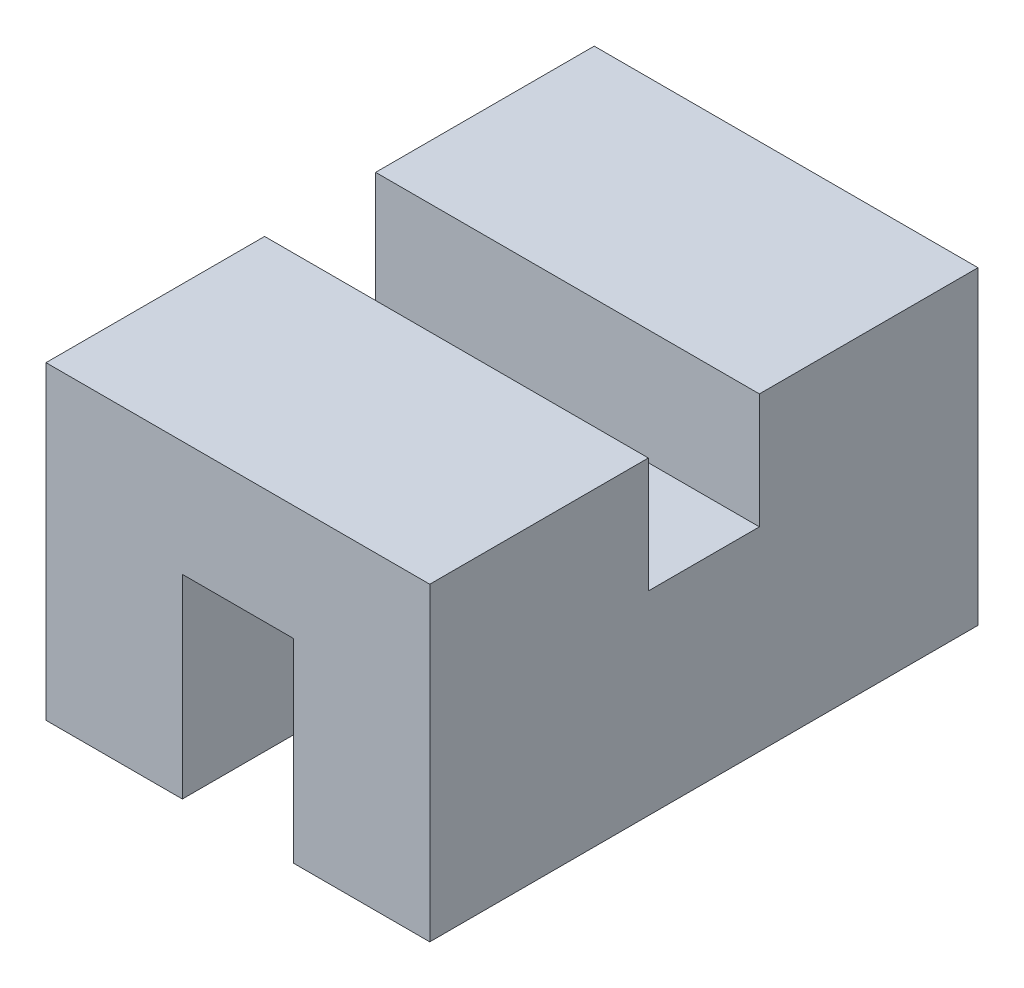
ISO-10303-21;
HEADER;
FILE_DESCRIPTION(('STEP AP214'),'2;1');
FILE_NAME('part.step','',(''),(''),'','','');
FILE_SCHEMA(('AUTOMOTIVE_DESIGN { 1 0 10303 214 1 1 1 1 }'));
ENDSEC;
DATA;
#1=APPLICATION_CONTEXT('core data for automotive mechanical design processes');
#2=APPLICATION_PROTOCOL_DEFINITION('international standard','automotive_design',2000,#1);
#3=PRODUCT_CONTEXT('',#1,'mechanical');
#4=PRODUCT('Part','Part','',(#3));
#5=PRODUCT_RELATED_PRODUCT_CATEGORY('part','',(#4));
#6=PRODUCT_DEFINITION_FORMATION('','',#4);
#7=PRODUCT_DEFINITION_CONTEXT('part definition',#1,'design');
#8=PRODUCT_DEFINITION('design','',#6,#7);
#9=PRODUCT_DEFINITION_SHAPE('','',#8);
#10=(LENGTH_UNIT() NAMED_UNIT(*) SI_UNIT(.MILLI.,.METRE.));
#11=(NAMED_UNIT(*) PLANE_ANGLE_UNIT() SI_UNIT($,.RADIAN.));
#12=(NAMED_UNIT(*) SI_UNIT($,.STERADIAN.) SOLID_ANGLE_UNIT());
#13=UNCERTAINTY_MEASURE_WITH_UNIT(LENGTH_MEASURE(1.E-05),#10,'distance_accuracy_value','');
#14=(GEOMETRIC_REPRESENTATION_CONTEXT(3) GLOBAL_UNCERTAINTY_ASSIGNED_CONTEXT((#13)) GLOBAL_UNIT_ASSIGNED_CONTEXT((#10,
#11,#12)) REPRESENTATION_CONTEXT('',''));
#15=CARTESIAN_POINT('',(0.,0.,0.));
#16=DIRECTION('',(0.,0.,1.));
#17=DIRECTION('',(1.,0.,0.));
#18=AXIS2_PLACEMENT_3D('',#15,#16,#17);
#19=CARTESIAN_POINT('',(0.,5.8,0.));
#20=DIRECTION('',(0.,-1.,0.));
#21=DIRECTION('',(0.,0.,-1.));
#22=AXIS2_PLACEMENT_3D('',#19,#20,#21);
#23=PLANE('',#22);
#24=DIRECTION('',(-1.,0.,0.));
#25=VECTOR('',#24,1.);
#26=CARTESIAN_POINT('',(0.,5.8,-15.95));
#27=LINE('',#26,#25);
#28=CARTESIAN_POINT('',(9.95,5.8,-15.95));
#29=VERTEX_POINT('',#28);
#30=CARTESIAN_POINT('',(0.,5.8,-15.95));
#31=VERTEX_POINT('',#30);
#32=EDGE_CURVE('E208',#29,#31,#27,.T.);
#33=ORIENTED_EDGE('',*,*,#32,.F.);
#34=DIRECTION('',(0.,0.,1.));
#35=VECTOR('',#34,1.);
#36=CARTESIAN_POINT('',(9.95,5.8,0.));
#37=LINE('',#36,#35);
#38=CARTESIAN_POINT('',(9.95,5.8,-24.05));
#39=VERTEX_POINT('',#38);
#40=EDGE_CURVE('E160',#39,#29,#37,.T.);
#41=ORIENTED_EDGE('',*,*,#40,.F.);
#42=DIRECTION('',(1.,0.,0.));
#43=VECTOR('',#42,1.);
#44=CARTESIAN_POINT('',(0.,5.8,-24.05));
#45=LINE('',#44,#43);
#46=CARTESIAN_POINT('',(0.,5.8,-24.05));
#47=VERTEX_POINT('',#46);
#48=EDGE_CURVE('E191',#47,#39,#45,.T.);
#49=ORIENTED_EDGE('',*,*,#48,.F.);
#50=DIRECTION('',(0.,0.,1.));
#51=VECTOR('',#50,1.);
#52=CARTESIAN_POINT('',(0.,5.8,0.));
#53=LINE('',#52,#51);
#54=EDGE_CURVE('E230',#47,#31,#53,.T.);
#55=ORIENTED_EDGE('',*,*,#54,.T.);
#56=EDGE_LOOP('',(#33,#41,#49,#55));
#57=FACE_BOUND('',#56,.T.);
#58=ADVANCED_FACE('F32',(#57),#23,.F.);
#59=CARTESIAN_POINT('',(18.05,5.8,-24.05));
#60=VERTEX_POINT('',#59);
#61=CARTESIAN_POINT('',(28.,5.8,-24.05));
#62=VERTEX_POINT('',#61);
#63=EDGE_CURVE('E55',#60,#62,#45,.T.);
#64=ORIENTED_EDGE('',*,*,#63,.F.);
#65=DIRECTION('',(0.,0.,-1.));
#66=VECTOR('',#65,1.);
#67=CARTESIAN_POINT('',(18.05,5.8,0.));
#68=LINE('',#67,#66);
#69=CARTESIAN_POINT('',(18.05,5.8,-15.95));
#70=VERTEX_POINT('',#69);
#71=EDGE_CURVE('E47',#70,#60,#68,.T.);
#72=ORIENTED_EDGE('',*,*,#71,.F.);
#73=CARTESIAN_POINT('',(28.,5.8,-15.95));
#74=VERTEX_POINT('',#73);
#75=EDGE_CURVE('E213',#74,#70,#27,.T.);
#76=ORIENTED_EDGE('',*,*,#75,.F.);
#77=DIRECTION('',(0.,0.,-1.));
#78=VECTOR('',#77,1.);
#79=CARTESIAN_POINT('',(28.,5.8,-40.));
#80=LINE('',#79,#78);
#81=EDGE_CURVE('E228',#74,#62,#80,.T.);
#82=ORIENTED_EDGE('',*,*,#81,.T.);
#83=EDGE_LOOP('',(#64,#72,#76,#82));
#84=FACE_BOUND('',#83,.T.);
#85=ADVANCED_FACE('F273',(#84),#23,.F.);
#86=CARTESIAN_POINT('',(28.,5.8,0.));
#87=DIRECTION('',(0.,0.,-1.));
#88=DIRECTION('',(-1.,0.,0.));
#89=AXIS2_PLACEMENT_3D('',#86,#87,#88);
#90=PLANE('',#89);
#91=DIRECTION('',(0.,1.,0.));
#92=VECTOR('',#91,1.);
#93=CARTESIAN_POINT('',(9.95,-8.4,0.));
#94=LINE('',#93,#92);
#95=CARTESIAN_POINT('',(9.95,-8.4,0.));
#96=VERTEX_POINT('',#95);
#97=CARTESIAN_POINT('',(9.95,5.8,0.));
#98=VERTEX_POINT('',#97);
#99=EDGE_CURVE('E183',#96,#98,#94,.T.);
#100=ORIENTED_EDGE('',*,*,#99,.T.);
#101=DIRECTION('',(1.,0.,0.));
#102=VECTOR('',#101,1.);
#103=CARTESIAN_POINT('',(9.95,5.8,0.));
#104=LINE('',#103,#102);
#105=CARTESIAN_POINT('',(18.05,5.8,0.));
#106=VERTEX_POINT('',#105);
#107=EDGE_CURVE('E269',#98,#106,#104,.T.);
#108=ORIENTED_EDGE('',*,*,#107,.T.);
#109=DIRECTION('',(0.,1.,0.));
#110=VECTOR('',#109,1.);
#111=CARTESIAN_POINT('',(18.05,-8.4,0.));
#112=LINE('',#111,#110);
#113=CARTESIAN_POINT('',(18.05,-8.4,0.));
#114=VERTEX_POINT('',#113);
#115=EDGE_CURVE('E144',#114,#106,#112,.T.);
#116=ORIENTED_EDGE('',*,*,#115,.F.);
#117=DIRECTION('',(-1.,0.,0.));
#118=VECTOR('',#117,1.);
#119=CARTESIAN_POINT('',(18.05,-8.4,0.));
#120=LINE('',#119,#118);
#121=CARTESIAN_POINT('',(28.,-8.4,0.));
#122=VERTEX_POINT('',#121);
#123=EDGE_CURVE('E158',#122,#114,#120,.T.);
#124=ORIENTED_EDGE('',*,*,#123,.F.);
#125=DIRECTION('',(0.,-1.,0.));
#126=VECTOR('',#125,1.);
#127=CARTESIAN_POINT('',(28.,5.8,0.));
#128=LINE('',#127,#126);
#129=CARTESIAN_POINT('',(28.,14.2,0.));
#130=VERTEX_POINT('',#129);
#131=EDGE_CURVE('E11',#130,#122,#128,.T.);
#132=ORIENTED_EDGE('',*,*,#131,.F.);
#133=DIRECTION('',(1.,0.,0.));
#134=VECTOR('',#133,1.);
#135=CARTESIAN_POINT('',(0.,14.2,0.));
#136=LINE('',#135,#134);
#137=CARTESIAN_POINT('',(0.,14.2,0.));
#138=VERTEX_POINT('',#137);
#139=EDGE_CURVE('E212',#138,#130,#136,.T.);
#140=ORIENTED_EDGE('',*,*,#139,.F.);
#141=DIRECTION('',(0.,-1.,0.));
#142=VECTOR('',#141,1.);
#143=CARTESIAN_POINT('',(0.,5.8,0.));
#144=LINE('',#143,#142);
#145=CARTESIAN_POINT('',(0.,-8.4,0.));
#146=VERTEX_POINT('',#145);
#147=EDGE_CURVE('E233',#138,#146,#144,.T.);
#148=ORIENTED_EDGE('',*,*,#147,.T.);
#149=DIRECTION('',(-1.,0.,0.));
#150=VECTOR('',#149,1.);
#151=CARTESIAN_POINT('',(0.,-8.4,0.));
#152=LINE('',#151,#150);
#153=EDGE_CURVE('E180',#96,#146,#152,.T.);
#154=ORIENTED_EDGE('',*,*,#153,.F.);
#155=EDGE_LOOP('',(#100,#108,#116,#124,#132,#140,#148,#154));
#156=FACE_BOUND('',#155,.T.);
#157=ADVANCED_FACE('F34',(#156),#90,.F.);
#158=CARTESIAN_POINT('',(28.,5.8,-40.));
#159=DIRECTION('',(-1.,0.,0.));
#160=DIRECTION('',(0.,0.,1.));
#161=AXIS2_PLACEMENT_3D('',#158,#159,#160);
#162=PLANE('',#161);
#163=ORIENTED_EDGE('',*,*,#131,.T.);
#164=DIRECTION('',(0.,0.,1.));
#165=VECTOR('',#164,1.);
#166=CARTESIAN_POINT('',(28.,-8.4,0.));
#167=LINE('',#166,#165);
#168=CARTESIAN_POINT('',(28.,-8.4,-40.));
#169=VERTEX_POINT('',#168);
#170=EDGE_CURVE('E145',#169,#122,#167,.T.);
#171=ORIENTED_EDGE('',*,*,#170,.F.);
#172=DIRECTION('',(0.,-1.,0.));
#173=VECTOR('',#172,1.);
#174=CARTESIAN_POINT('',(28.,5.8,-40.));
#175=LINE('',#174,#173);
#176=CARTESIAN_POINT('',(28.,14.2,-40.));
#177=VERTEX_POINT('',#176);
#178=EDGE_CURVE('E40',#177,#169,#175,.T.);
#179=ORIENTED_EDGE('',*,*,#178,.F.);
#180=DIRECTION('',(0.,0.,-1.));
#181=VECTOR('',#180,1.);
#182=CARTESIAN_POINT('',(28.,14.2,-40.));
#183=LINE('',#182,#181);
#184=CARTESIAN_POINT('',(28.,14.2,-24.05));
#185=VERTEX_POINT('',#184);
#186=EDGE_CURVE('E193',#185,#177,#183,.T.);
#187=ORIENTED_EDGE('',*,*,#186,.F.);
#188=DIRECTION('',(0.,-1.,0.));
#189=VECTOR('',#188,1.);
#190=CARTESIAN_POINT('',(28.,14.2,-24.05));
#191=LINE('',#190,#189);
#192=EDGE_CURVE('E199',#185,#62,#191,.T.);
#193=ORIENTED_EDGE('',*,*,#192,.T.);
#194=ORIENTED_EDGE('',*,*,#81,.F.);
#195=DIRECTION('',(0.,-1.,0.));
#196=VECTOR('',#195,1.);
#197=CARTESIAN_POINT('',(28.,14.2,-15.95));
#198=LINE('',#197,#196);
#199=CARTESIAN_POINT('',(28.,14.2,-15.95));
#200=VERTEX_POINT('',#199);
#201=EDGE_CURVE('E225',#200,#74,#198,.T.);
#202=ORIENTED_EDGE('',*,*,#201,.F.);
#203=DIRECTION('',(0.,0.,-1.));
#204=VECTOR('',#203,1.);
#205=CARTESIAN_POINT('',(28.,14.2,0.));
#206=LINE('',#205,#204);
#207=EDGE_CURVE('E216',#130,#200,#206,.T.);
#208=ORIENTED_EDGE('',*,*,#207,.F.);
#209=EDGE_LOOP('',(#163,#171,#179,#187,#193,#194,#202,#208));
#210=FACE_BOUND('',#209,.T.);
#211=ADVANCED_FACE('F243',(#210),#162,.F.);
#212=CARTESIAN_POINT('',(0.,5.8,-40.));
#213=DIRECTION('',(0.,0.,1.));
#214=DIRECTION('',(1.,0.,0.));
#215=AXIS2_PLACEMENT_3D('',#212,#213,#214);
#216=PLANE('',#215);
#217=DIRECTION('',(-1.,0.,0.));
#218=VECTOR('',#217,1.);
#219=CARTESIAN_POINT('',(9.95,5.8,-40.));
#220=LINE('',#219,#218);
#221=CARTESIAN_POINT('',(18.05,5.8,-40.));
#222=VERTEX_POINT('',#221);
#223=CARTESIAN_POINT('',(9.95,5.8,-40.));
#224=VERTEX_POINT('',#223);
#225=EDGE_CURVE('E141',#222,#224,#220,.T.);
#226=ORIENTED_EDGE('',*,*,#225,.T.);
#227=DIRECTION('',(0.,1.,0.));
#228=VECTOR('',#227,1.);
#229=CARTESIAN_POINT('',(9.95,-8.4,-40.));
#230=LINE('',#229,#228);
#231=CARTESIAN_POINT('',(9.95,-8.4,-40.));
#232=VERTEX_POINT('',#231);
#233=EDGE_CURVE('E185',#232,#224,#230,.T.);
#234=ORIENTED_EDGE('',*,*,#233,.F.);
#235=DIRECTION('',(1.,0.,0.));
#236=VECTOR('',#235,1.);
#237=CARTESIAN_POINT('',(0.,-8.4,-40.));
#238=LINE('',#237,#236);
#239=CARTESIAN_POINT('',(0.,-8.4,-40.));
#240=VERTEX_POINT('',#239);
#241=EDGE_CURVE('E176',#240,#232,#238,.T.);
#242=ORIENTED_EDGE('',*,*,#241,.F.);
#243=DIRECTION('',(0.,-1.,0.));
#244=VECTOR('',#243,1.);
#245=CARTESIAN_POINT('',(0.,5.8,-40.));
#246=LINE('',#245,#244);
#247=CARTESIAN_POINT('',(0.,14.2,-40.));
#248=VERTEX_POINT('',#247);
#249=EDGE_CURVE('E235',#248,#240,#246,.T.);
#250=ORIENTED_EDGE('',*,*,#249,.F.);
#251=DIRECTION('',(-1.,0.,0.));
#252=VECTOR('',#251,1.);
#253=CARTESIAN_POINT('',(0.,14.2,-40.));
#254=LINE('',#253,#252);
#255=EDGE_CURVE('E196',#177,#248,#254,.T.);
#256=ORIENTED_EDGE('',*,*,#255,.F.);
#257=ORIENTED_EDGE('',*,*,#178,.T.);
#258=DIRECTION('',(1.,0.,0.));
#259=VECTOR('',#258,1.);
#260=CARTESIAN_POINT('',(18.05,-8.4,-40.));
#261=LINE('',#260,#259);
#262=CARTESIAN_POINT('',(18.05,-8.4,-40.));
#263=VERTEX_POINT('',#262);
#264=EDGE_CURVE('E143',#263,#169,#261,.T.);
#265=ORIENTED_EDGE('',*,*,#264,.F.);
#266=DIRECTION('',(0.,1.,0.));
#267=VECTOR('',#266,1.);
#268=CARTESIAN_POINT('',(18.05,-8.4,-40.));
#269=LINE('',#268,#267);
#270=EDGE_CURVE('E137',#263,#222,#269,.T.);
#271=ORIENTED_EDGE('',*,*,#270,.T.);
#272=EDGE_LOOP('',(#226,#234,#242,#250,#256,#257,#265,#271));
#273=FACE_BOUND('',#272,.T.);
#274=ADVANCED_FACE('F138',(#273),#216,.F.);
#275=CARTESIAN_POINT('',(0.,5.8,0.));
#276=DIRECTION('',(1.,0.,0.));
#277=DIRECTION('',(0.,0.,-1.));
#278=AXIS2_PLACEMENT_3D('',#275,#276,#277);
#279=PLANE('',#278);
#280=ORIENTED_EDGE('',*,*,#249,.T.);
#281=DIRECTION('',(0.,0.,-1.));
#282=VECTOR('',#281,1.);
#283=CARTESIAN_POINT('',(0.,-8.4,0.));
#284=LINE('',#283,#282);
#285=EDGE_CURVE('E173',#146,#240,#284,.T.);
#286=ORIENTED_EDGE('',*,*,#285,.F.);
#287=ORIENTED_EDGE('',*,*,#147,.F.);
#288=DIRECTION('',(0.,0.,1.));
#289=VECTOR('',#288,1.);
#290=CARTESIAN_POINT('',(0.,14.2,0.));
#291=LINE('',#290,#289);
#292=CARTESIAN_POINT('',(0.,14.2,-15.95));
#293=VERTEX_POINT('',#292);
#294=EDGE_CURVE('E209',#293,#138,#291,.T.);
#295=ORIENTED_EDGE('',*,*,#294,.F.);
#296=DIRECTION('',(0.,-1.,0.));
#297=VECTOR('',#296,1.);
#298=CARTESIAN_POINT('',(0.,14.2,-15.95));
#299=LINE('',#298,#297);
#300=EDGE_CURVE('E220',#293,#31,#299,.T.);
#301=ORIENTED_EDGE('',*,*,#300,.T.);
#302=ORIENTED_EDGE('',*,*,#54,.F.);
#303=DIRECTION('',(0.,-1.,0.));
#304=VECTOR('',#303,1.);
#305=CARTESIAN_POINT('',(0.,14.2,-24.05));
#306=LINE('',#305,#304);
#307=CARTESIAN_POINT('',(0.,14.2,-24.05));
#308=VERTEX_POINT('',#307);
#309=EDGE_CURVE('E205',#308,#47,#306,.T.);
#310=ORIENTED_EDGE('',*,*,#309,.F.);
#311=DIRECTION('',(0.,0.,1.));
#312=VECTOR('',#311,1.);
#313=CARTESIAN_POINT('',(0.,14.2,-40.));
#314=LINE('',#313,#312);
#315=EDGE_CURVE('E187',#248,#308,#314,.T.);
#316=ORIENTED_EDGE('',*,*,#315,.F.);
#317=EDGE_LOOP('',(#280,#286,#287,#295,#301,#302,#310,#316));
#318=FACE_BOUND('',#317,.T.);
#319=ADVANCED_FACE('F255',(#318),#279,.F.);
#320=CARTESIAN_POINT('',(0.,14.2,-15.95));
#321=DIRECTION('',(0.,0.,1.));
#322=DIRECTION('',(1.,0.,0.));
#323=AXIS2_PLACEMENT_3D('',#320,#321,#322);
#324=PLANE('',#323);
#325=ORIENTED_EDGE('',*,*,#75,.T.);
#326=DIRECTION('',(1.,0.,0.));
#327=VECTOR('',#326,1.);
#328=CARTESIAN_POINT('',(0.,5.8,-15.95));
#329=LINE('',#328,#327);
#330=EDGE_CURVE('E156',#29,#70,#329,.T.);
#331=ORIENTED_EDGE('',*,*,#330,.F.);
#332=ORIENTED_EDGE('',*,*,#32,.T.);
#333=ORIENTED_EDGE('',*,*,#300,.F.);
#334=DIRECTION('',(-1.,0.,0.));
#335=VECTOR('',#334,1.);
#336=CARTESIAN_POINT('',(0.,14.2,-15.95));
#337=LINE('',#336,#335);
#338=EDGE_CURVE('E218',#200,#293,#337,.T.);
#339=ORIENTED_EDGE('',*,*,#338,.F.);
#340=ORIENTED_EDGE('',*,*,#201,.T.);
#341=EDGE_LOOP('',(#325,#331,#332,#333,#339,#340));
#342=FACE_BOUND('',#341,.T.);
#343=ADVANCED_FACE('F277',(#342),#324,.F.);
#344=CARTESIAN_POINT('',(0.,14.2,0.));
#345=DIRECTION('',(0.,-1.,0.));
#346=DIRECTION('',(0.,0.,-1.));
#347=AXIS2_PLACEMENT_3D('',#344,#345,#346);
#348=PLANE('',#347);
#349=ORIENTED_EDGE('',*,*,#294,.T.);
#350=ORIENTED_EDGE('',*,*,#139,.T.);
#351=ORIENTED_EDGE('',*,*,#207,.T.);
#352=ORIENTED_EDGE('',*,*,#338,.T.);
#353=EDGE_LOOP('',(#349,#350,#351,#352));
#354=FACE_BOUND('',#353,.T.);
#355=ADVANCED_FACE('F250',(#354),#348,.F.);
#356=CARTESIAN_POINT('',(0.,14.2,-24.05));
#357=DIRECTION('',(0.,0.,-1.));
#358=DIRECTION('',(-1.,0.,0.));
#359=AXIS2_PLACEMENT_3D('',#356,#357,#358);
#360=PLANE('',#359);
#361=ORIENTED_EDGE('',*,*,#48,.T.);
#362=EDGE_CURVE('E202',#39,#60,#45,.T.);
#363=ORIENTED_EDGE('',*,*,#362,.T.);
#364=ORIENTED_EDGE('',*,*,#63,.T.);
#365=ORIENTED_EDGE('',*,*,#192,.F.);
#366=DIRECTION('',(1.,0.,0.));
#367=VECTOR('',#366,1.);
#368=CARTESIAN_POINT('',(0.,14.2,-24.05));
#369=LINE('',#368,#367);
#370=EDGE_CURVE('E190',#308,#185,#369,.T.);
#371=ORIENTED_EDGE('',*,*,#370,.F.);
#372=ORIENTED_EDGE('',*,*,#309,.T.);
#373=EDGE_LOOP('',(#361,#363,#364,#365,#371,#372));
#374=FACE_BOUND('',#373,.T.);
#375=ADVANCED_FACE('F278',(#374),#360,.F.);
#376=CARTESIAN_POINT('',(0.,14.2,0.));
#377=DIRECTION('',(0.,1.,0.));
#378=DIRECTION('',(0.,0.,1.));
#379=AXIS2_PLACEMENT_3D('',#376,#377,#378);
#380=PLANE('',#379);
#381=ORIENTED_EDGE('',*,*,#315,.T.);
#382=ORIENTED_EDGE('',*,*,#370,.T.);
#383=ORIENTED_EDGE('',*,*,#186,.T.);
#384=ORIENTED_EDGE('',*,*,#255,.T.);
#385=EDGE_LOOP('',(#381,#382,#383,#384));
#386=FACE_BOUND('',#385,.T.);
#387=ADVANCED_FACE('F282',(#386),#380,.T.);
#388=CARTESIAN_POINT('',(9.95,-8.4,0.));
#389=DIRECTION('',(-1.,0.,0.));
#390=DIRECTION('',(0.,0.,1.));
#391=AXIS2_PLACEMENT_3D('',#388,#389,#390);
#392=PLANE('',#391);
#393=ORIENTED_EDGE('',*,*,#233,.T.);
#394=EDGE_CURVE('E155',#224,#39,#37,.T.);
#395=ORIENTED_EDGE('',*,*,#394,.T.);
#396=ORIENTED_EDGE('',*,*,#40,.T.);
#397=EDGE_CURVE('E162',#29,#98,#37,.T.);
#398=ORIENTED_EDGE('',*,*,#397,.T.);
#399=ORIENTED_EDGE('',*,*,#99,.F.);
#400=DIRECTION('',(0.,0.,1.));
#401=VECTOR('',#400,1.);
#402=CARTESIAN_POINT('',(9.95,-8.4,0.));
#403=LINE('',#402,#401);
#404=EDGE_CURVE('E178',#232,#96,#403,.T.);
#405=ORIENTED_EDGE('',*,*,#404,.F.);
#406=EDGE_LOOP('',(#393,#395,#396,#398,#399,#405));
#407=FACE_BOUND('',#406,.T.);
#408=ADVANCED_FACE('F265',(#407),#392,.F.);
#409=CARTESIAN_POINT('',(0.,-8.4,0.));
#410=DIRECTION('',(0.,-1.,0.));
#411=DIRECTION('',(0.,0.,-1.));
#412=AXIS2_PLACEMENT_3D('',#409,#410,#411);
#413=PLANE('',#412);
#414=ORIENTED_EDGE('',*,*,#285,.T.);
#415=ORIENTED_EDGE('',*,*,#241,.T.);
#416=ORIENTED_EDGE('',*,*,#404,.T.);
#417=ORIENTED_EDGE('',*,*,#153,.T.);
#418=EDGE_LOOP('',(#414,#415,#416,#417));
#419=FACE_BOUND('',#418,.T.);
#420=ADVANCED_FACE('F259',(#419),#413,.T.);
#421=CARTESIAN_POINT('',(18.05,-8.4,0.));
#422=DIRECTION('',(1.,0.,0.));
#423=DIRECTION('',(0.,0.,-1.));
#424=AXIS2_PLACEMENT_3D('',#421,#422,#423);
#425=PLANE('',#424);
#426=ORIENTED_EDGE('',*,*,#115,.T.);
#427=EDGE_CURVE('E151',#106,#70,#68,.T.);
#428=ORIENTED_EDGE('',*,*,#427,.T.);
#429=ORIENTED_EDGE('',*,*,#71,.T.);
#430=EDGE_CURVE('E147',#60,#222,#68,.T.);
#431=ORIENTED_EDGE('',*,*,#430,.T.);
#432=ORIENTED_EDGE('',*,*,#270,.F.);
#433=DIRECTION('',(0.,0.,-1.));
#434=VECTOR('',#433,1.);
#435=CARTESIAN_POINT('',(18.05,-8.4,0.));
#436=LINE('',#435,#434);
#437=EDGE_CURVE('E167',#114,#263,#436,.T.);
#438=ORIENTED_EDGE('',*,*,#437,.F.);
#439=EDGE_LOOP('',(#426,#428,#429,#431,#432,#438));
#440=FACE_BOUND('',#439,.T.);
#441=ADVANCED_FACE('F148',(#440),#425,.F.);
#442=CARTESIAN_POINT('',(0.,-8.4,0.));
#443=DIRECTION('',(0.,1.,0.));
#444=DIRECTION('',(0.,0.,1.));
#445=AXIS2_PLACEMENT_3D('',#442,#443,#444);
#446=PLANE('',#445);
#447=ORIENTED_EDGE('',*,*,#123,.T.);
#448=ORIENTED_EDGE('',*,*,#437,.T.);
#449=ORIENTED_EDGE('',*,*,#264,.T.);
#450=ORIENTED_EDGE('',*,*,#170,.T.);
#451=EDGE_LOOP('',(#447,#448,#449,#450));
#452=FACE_BOUND('',#451,.T.);
#453=ADVANCED_FACE('F241',(#452),#446,.F.);
#454=CARTESIAN_POINT('',(0.,5.8,0.));
#455=DIRECTION('',(0.,-1.,0.));
#456=DIRECTION('',(0.,0.,-1.));
#457=AXIS2_PLACEMENT_3D('',#454,#455,#456);
#458=PLANE('',#457);
#459=ORIENTED_EDGE('',*,*,#330,.T.);
#460=ORIENTED_EDGE('',*,*,#427,.F.);
#461=ORIENTED_EDGE('',*,*,#107,.F.);
#462=ORIENTED_EDGE('',*,*,#397,.F.);
#463=EDGE_LOOP('',(#459,#460,#461,#462));
#464=FACE_BOUND('',#463,.T.);
#465=ADVANCED_FACE('F325',(#464),#458,.T.);
#466=ORIENTED_EDGE('',*,*,#362,.F.);
#467=ORIENTED_EDGE('',*,*,#394,.F.);
#468=ORIENTED_EDGE('',*,*,#225,.F.);
#469=ORIENTED_EDGE('',*,*,#430,.F.);
#470=EDGE_LOOP('',(#466,#467,#468,#469));
#471=FACE_BOUND('',#470,.T.);
#472=ADVANCED_FACE('F153',(#471),#458,.T.);
#473=CLOSED_SHELL('',(#58,#85,#157,#211,#274,#319,#343,#355,#375,#387,#408,#420,#441,#453,#465,#472));
#474=MANIFOLD_SOLID_BREP('B2',#473);
#475=ADVANCED_BREP_SHAPE_REPRESENTATION('',(#18,#474),#14);
#476=SHAPE_DEFINITION_REPRESENTATION(#9,#475);
ENDSEC;
END-ISO-10303-21;
